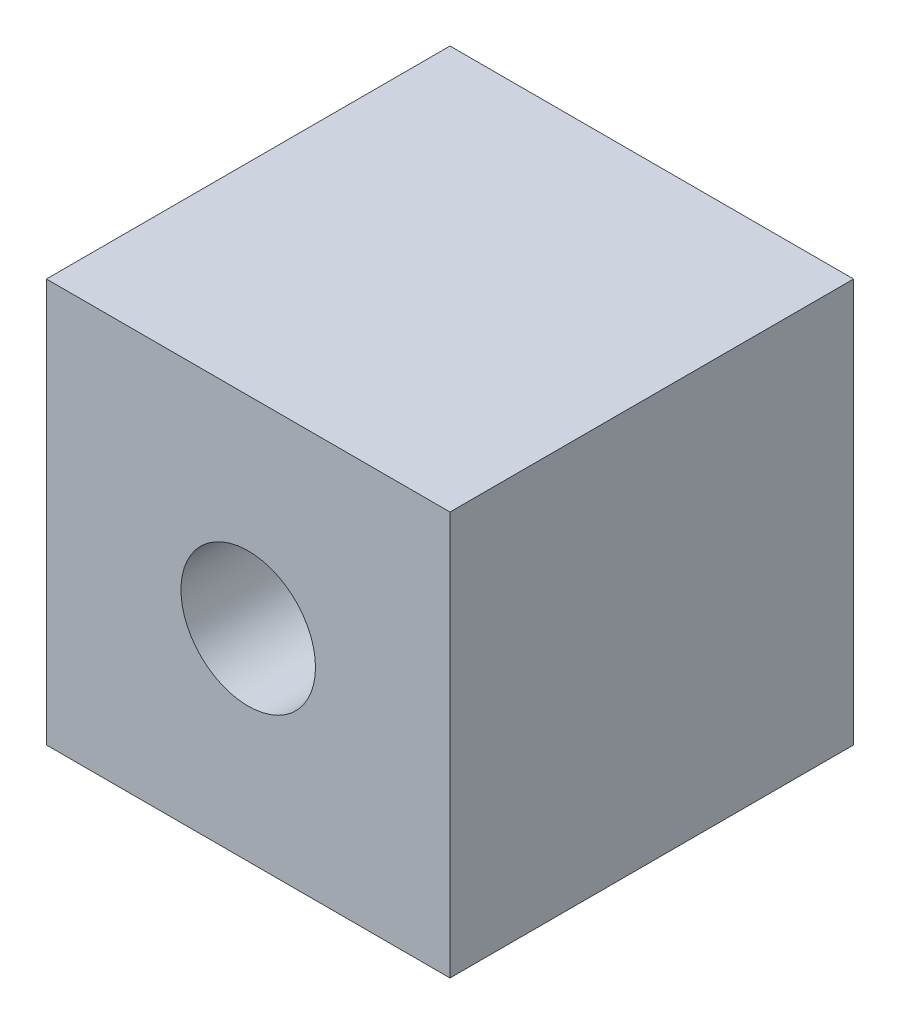
ISO-10303-21;
HEADER;
FILE_DESCRIPTION(('STEP AP214'),'2;1');
FILE_NAME('part.step','',(''),(''),'','','');
FILE_SCHEMA(('AUTOMOTIVE_DESIGN { 1 0 10303 214 1 1 1 1 }'));
ENDSEC;
DATA;
#1=APPLICATION_CONTEXT('core data for automotive mechanical design processes');
#2=APPLICATION_PROTOCOL_DEFINITION('international standard','automotive_design',2000,#1);
#3=PRODUCT_CONTEXT('',#1,'mechanical');
#4=PRODUCT('Part','Part','',(#3));
#5=PRODUCT_RELATED_PRODUCT_CATEGORY('part','',(#4));
#6=PRODUCT_DEFINITION_FORMATION('','',#4);
#7=PRODUCT_DEFINITION_CONTEXT('part definition',#1,'design');
#8=PRODUCT_DEFINITION('design','',#6,#7);
#9=PRODUCT_DEFINITION_SHAPE('','',#8);
#10=(LENGTH_UNIT() NAMED_UNIT(*) SI_UNIT(.MILLI.,.METRE.));
#11=(NAMED_UNIT(*) PLANE_ANGLE_UNIT() SI_UNIT($,.RADIAN.));
#12=(NAMED_UNIT(*) SI_UNIT($,.STERADIAN.) SOLID_ANGLE_UNIT());
#13=UNCERTAINTY_MEASURE_WITH_UNIT(LENGTH_MEASURE(1.E-05),#10,'distance_accuracy_value','');
#14=(GEOMETRIC_REPRESENTATION_CONTEXT(3) GLOBAL_UNCERTAINTY_ASSIGNED_CONTEXT((#13)) GLOBAL_UNIT_ASSIGNED_CONTEXT((#10,
#11,#12)) REPRESENTATION_CONTEXT('',''));
#15=CARTESIAN_POINT('',(0.,0.,0.));
#16=DIRECTION('',(0.,0.,1.));
#17=DIRECTION('',(1.,0.,0.));
#18=AXIS2_PLACEMENT_3D('',#15,#16,#17);
#19=CARTESIAN_POINT('',(38.1,-38.1,76.2));
#20=DIRECTION('',(-1.,0.,0.));
#21=DIRECTION('',(0.,0.,1.));
#22=AXIS2_PLACEMENT_3D('',#19,#20,#21);
#23=PLANE('',#22);
#24=DIRECTION('',(0.,1.,0.));
#25=VECTOR('',#24,1.);
#26=CARTESIAN_POINT('',(38.1,-38.1,0.));
#27=LINE('',#26,#25);
#28=CARTESIAN_POINT('',(38.1,-38.1,0.));
#29=VERTEX_POINT('',#28);
#30=CARTESIAN_POINT('',(38.1,38.1,0.));
#31=VERTEX_POINT('',#30);
#32=EDGE_CURVE('E106',#29,#31,#27,.T.);
#33=ORIENTED_EDGE('',*,*,#32,.T.);
#34=DIRECTION('',(0.,0.,-1.));
#35=VECTOR('',#34,1.);
#36=CARTESIAN_POINT('',(38.1,38.1,76.2));
#37=LINE('',#36,#35);
#38=CARTESIAN_POINT('',(38.1,38.1,76.2));
#39=VERTEX_POINT('',#38);
#40=EDGE_CURVE('E11',#39,#31,#37,.T.);
#41=ORIENTED_EDGE('',*,*,#40,.F.);
#42=DIRECTION('',(0.,1.,0.));
#43=VECTOR('',#42,1.);
#44=CARTESIAN_POINT('',(38.1,-38.1,76.2));
#45=LINE('',#44,#43);
#46=CARTESIAN_POINT('',(38.1,-38.1,76.2));
#47=VERTEX_POINT('',#46);
#48=EDGE_CURVE('E94',#47,#39,#45,.T.);
#49=ORIENTED_EDGE('',*,*,#48,.F.);
#50=DIRECTION('',(0.,0.,-1.));
#51=VECTOR('',#50,1.);
#52=CARTESIAN_POINT('',(38.1,-38.1,76.2));
#53=LINE('',#52,#51);
#54=EDGE_CURVE('E102',#47,#29,#53,.T.);
#55=ORIENTED_EDGE('',*,*,#54,.T.);
#56=EDGE_LOOP('',(#33,#41,#49,#55));
#57=FACE_BOUND('',#56,.T.);
#58=ADVANCED_FACE('F43',(#57),#23,.F.);
#59=CARTESIAN_POINT('',(-38.1,38.1,76.2));
#60=DIRECTION('',(0.,-1.,0.));
#61=DIRECTION('',(0.,0.,-1.));
#62=AXIS2_PLACEMENT_3D('',#59,#60,#61);
#63=PLANE('',#62);
#64=DIRECTION('',(-1.,0.,0.));
#65=VECTOR('',#64,1.);
#66=CARTESIAN_POINT('',(-38.1,38.1,0.));
#67=LINE('',#66,#65);
#68=CARTESIAN_POINT('',(-38.1,38.1,0.));
#69=VERTEX_POINT('',#68);
#70=EDGE_CURVE('E98',#31,#69,#67,.T.);
#71=ORIENTED_EDGE('',*,*,#70,.T.);
#72=DIRECTION('',(0.,0.,-1.));
#73=VECTOR('',#72,1.);
#74=CARTESIAN_POINT('',(-38.1,38.1,76.2));
#75=LINE('',#74,#73);
#76=CARTESIAN_POINT('',(-38.1,38.1,76.2));
#77=VERTEX_POINT('',#76);
#78=EDGE_CURVE('E51',#77,#69,#75,.T.);
#79=ORIENTED_EDGE('',*,*,#78,.F.);
#80=DIRECTION('',(-1.,0.,0.));
#81=VECTOR('',#80,1.);
#82=CARTESIAN_POINT('',(-38.1,38.1,76.2));
#83=LINE('',#82,#81);
#84=EDGE_CURVE('E89',#39,#77,#83,.T.);
#85=ORIENTED_EDGE('',*,*,#84,.F.);
#86=ORIENTED_EDGE('',*,*,#40,.T.);
#87=EDGE_LOOP('',(#71,#79,#85,#86));
#88=FACE_BOUND('',#87,.T.);
#89=ADVANCED_FACE('F97',(#88),#63,.F.);
#90=CARTESIAN_POINT('',(-38.1,-38.1,76.2));
#91=DIRECTION('',(1.,0.,0.));
#92=DIRECTION('',(0.,0.,-1.));
#93=AXIS2_PLACEMENT_3D('',#90,#91,#92);
#94=PLANE('',#93);
#95=DIRECTION('',(0.,-1.,0.));
#96=VECTOR('',#95,1.);
#97=CARTESIAN_POINT('',(-38.1,-38.1,0.));
#98=LINE('',#97,#96);
#99=CARTESIAN_POINT('',(-38.1,-38.1,0.));
#100=VERTEX_POINT('',#99);
#101=EDGE_CURVE('E76',#69,#100,#98,.T.);
#102=ORIENTED_EDGE('',*,*,#101,.T.);
#103=DIRECTION('',(0.,0.,-1.));
#104=VECTOR('',#103,1.);
#105=CARTESIAN_POINT('',(-38.1,-38.1,76.2));
#106=LINE('',#105,#104);
#107=CARTESIAN_POINT('',(-38.1,-38.1,76.2));
#108=VERTEX_POINT('',#107);
#109=EDGE_CURVE('E99',#108,#100,#106,.T.);
#110=ORIENTED_EDGE('',*,*,#109,.F.);
#111=DIRECTION('',(0.,-1.,0.));
#112=VECTOR('',#111,1.);
#113=CARTESIAN_POINT('',(-38.1,-38.1,76.2));
#114=LINE('',#113,#112);
#115=EDGE_CURVE('E92',#77,#108,#114,.T.);
#116=ORIENTED_EDGE('',*,*,#115,.F.);
#117=ORIENTED_EDGE('',*,*,#78,.T.);
#118=EDGE_LOOP('',(#102,#110,#116,#117));
#119=FACE_BOUND('',#118,.T.);
#120=ADVANCED_FACE('F100',(#119),#94,.F.);
#121=CARTESIAN_POINT('',(-38.1,-38.1,76.2));
#122=DIRECTION('',(0.,1.,0.));
#123=DIRECTION('',(0.,0.,1.));
#124=AXIS2_PLACEMENT_3D('',#121,#122,#123);
#125=PLANE('',#124);
#126=DIRECTION('',(1.,0.,0.));
#127=VECTOR('',#126,1.);
#128=CARTESIAN_POINT('',(-38.1,-38.1,0.));
#129=LINE('',#128,#127);
#130=EDGE_CURVE('E82',#100,#29,#129,.T.);
#131=ORIENTED_EDGE('',*,*,#130,.T.);
#132=ORIENTED_EDGE('',*,*,#54,.F.);
#133=DIRECTION('',(1.,0.,0.));
#134=VECTOR('',#133,1.);
#135=CARTESIAN_POINT('',(-38.1,-38.1,76.2));
#136=LINE('',#135,#134);
#137=EDGE_CURVE('E59',#108,#47,#136,.T.);
#138=ORIENTED_EDGE('',*,*,#137,.F.);
#139=ORIENTED_EDGE('',*,*,#109,.T.);
#140=EDGE_LOOP('',(#131,#132,#138,#139));
#141=FACE_BOUND('',#140,.T.);
#142=ADVANCED_FACE('F114',(#141),#125,.F.);
#143=CARTESIAN_POINT('',(0.,0.,76.2));
#144=DIRECTION('',(0.,0.,-1.));
#145=DIRECTION('',(-1.,0.,0.));
#146=AXIS2_PLACEMENT_3D('',#143,#144,#145);
#147=PLANE('',#146);
#148=CARTESIAN_POINT('',(0.,0.,76.2));
#149=DIRECTION('',(0.,0.,1.));
#150=DIRECTION('',(1.,0.,0.));
#151=AXIS2_PLACEMENT_3D('',#148,#149,#150);
#152=CIRCLE('',#151,12.7);
#153=CARTESIAN_POINT('',(12.7,0.,76.2));
#154=VERTEX_POINT('',#153);
#155=EDGE_CURVE('E120',#154,#154,#152,.T.);
#156=ORIENTED_EDGE('',*,*,#155,.F.);
#157=EDGE_LOOP('',(#156));
#158=FACE_BOUND('',#157,.T.);
#159=ORIENTED_EDGE('',*,*,#48,.T.);
#160=ORIENTED_EDGE('',*,*,#84,.T.);
#161=ORIENTED_EDGE('',*,*,#115,.T.);
#162=ORIENTED_EDGE('',*,*,#137,.T.);
#163=EDGE_LOOP('',(#159,#160,#161,#162));
#164=FACE_BOUND('',#163,.T.);
#165=ADVANCED_FACE('F90',(#158,#164),#147,.F.);
#166=CARTESIAN_POINT('',(0.,0.,0.));
#167=DIRECTION('',(0.,0.,-1.));
#168=DIRECTION('',(-1.,0.,0.));
#169=AXIS2_PLACEMENT_3D('',#166,#167,#168);
#170=PLANE('',#169);
#171=ORIENTED_EDGE('',*,*,#32,.F.);
#172=ORIENTED_EDGE('',*,*,#130,.F.);
#173=ORIENTED_EDGE('',*,*,#101,.F.);
#174=ORIENTED_EDGE('',*,*,#70,.F.);
#175=EDGE_LOOP('',(#171,#172,#173,#174));
#176=FACE_BOUND('',#175,.T.);
#177=ADVANCED_FACE('F117',(#176),#170,.T.);
#178=CARTESIAN_POINT('',(0.,0.,50.8));
#179=DIRECTION('',(0.,0.,1.));
#180=DIRECTION('',(1.,0.,0.));
#181=AXIS2_PLACEMENT_3D('',#178,#179,#180);
#182=CYLINDRICAL_SURFACE('',#181,12.7);
#183=CARTESIAN_POINT('',(0.,0.,50.8));
#184=DIRECTION('',(0.,0.,1.));
#185=DIRECTION('',(1.,0.,0.));
#186=AXIS2_PLACEMENT_3D('',#183,#184,#185);
#187=CIRCLE('',#186,12.7);
#188=CARTESIAN_POINT('',(12.7,0.,50.8));
#189=VERTEX_POINT('',#188);
#190=EDGE_CURVE('E109',#189,#189,#187,.T.);
#191=ORIENTED_EDGE('',*,*,#190,.F.);
#192=EDGE_LOOP('',(#191));
#193=FACE_BOUND('',#192,.T.);
#194=ORIENTED_EDGE('',*,*,#155,.T.);
#195=EDGE_LOOP('',(#194));
#196=FACE_BOUND('',#195,.T.);
#197=ADVANCED_FACE('F128',(#193,#196),#182,.F.);
#198=CARTESIAN_POINT('',(0.,0.,50.8));
#199=DIRECTION('',(0.,0.,1.));
#200=DIRECTION('',(1.,0.,0.));
#201=AXIS2_PLACEMENT_3D('',#198,#199,#200);
#202=PLANE('',#201);
#203=ORIENTED_EDGE('',*,*,#190,.T.);
#204=EDGE_LOOP('',(#203));
#205=FACE_BOUND('',#204,.T.);
#206=ADVANCED_FACE('F126',(#205),#202,.T.);
#207=CLOSED_SHELL('',(#58,#89,#120,#142,#165,#177,#197,#206));
#208=MANIFOLD_SOLID_BREP('B2',#207);
#209=ADVANCED_BREP_SHAPE_REPRESENTATION('',(#18,#208),#14);
#210=SHAPE_DEFINITION_REPRESENTATION(#9,#209);
ENDSEC;
END-ISO-10303-21;
